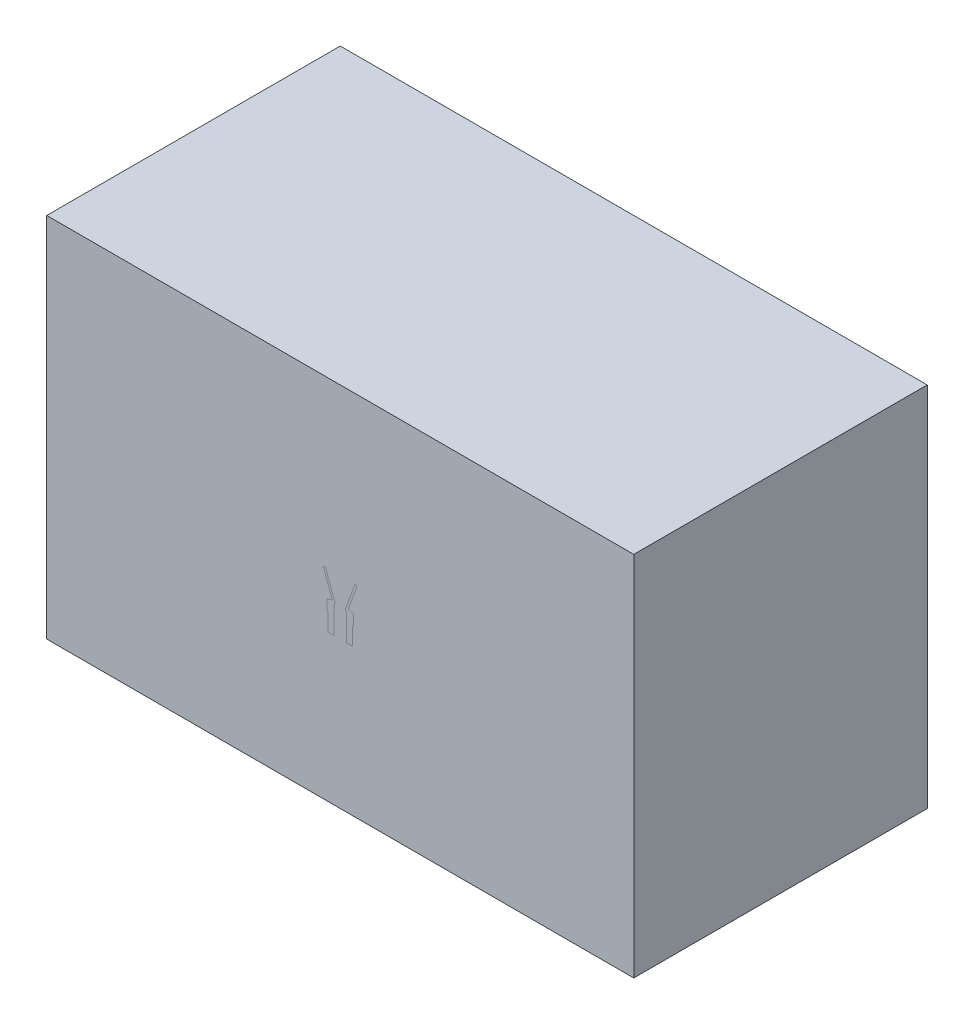
ISO-10303-21;
HEADER;
FILE_DESCRIPTION(('STEP AP214'),'2;1');
FILE_NAME('part.step','',(''),(''),'','','');
FILE_SCHEMA(('AUTOMOTIVE_DESIGN { 1 0 10303 214 1 1 1 1 }'));
ENDSEC;
DATA;
#1=APPLICATION_CONTEXT('core data for automotive mechanical design processes');
#2=APPLICATION_PROTOCOL_DEFINITION('international standard','automotive_design',2000,#1);
#3=PRODUCT_CONTEXT('',#1,'mechanical');
#4=PRODUCT('Part','Part','',(#3));
#5=PRODUCT_RELATED_PRODUCT_CATEGORY('part','',(#4));
#6=PRODUCT_DEFINITION_FORMATION('','',#4);
#7=PRODUCT_DEFINITION_CONTEXT('part definition',#1,'design');
#8=PRODUCT_DEFINITION('design','',#6,#7);
#9=PRODUCT_DEFINITION_SHAPE('','',#8);
#10=(LENGTH_UNIT() NAMED_UNIT(*) SI_UNIT(.MILLI.,.METRE.));
#11=(NAMED_UNIT(*) PLANE_ANGLE_UNIT() SI_UNIT($,.RADIAN.));
#12=(NAMED_UNIT(*) SI_UNIT($,.STERADIAN.) SOLID_ANGLE_UNIT());
#13=UNCERTAINTY_MEASURE_WITH_UNIT(LENGTH_MEASURE(1.E-05),#10,'distance_accuracy_value','');
#14=(GEOMETRIC_REPRESENTATION_CONTEXT(3) GLOBAL_UNCERTAINTY_ASSIGNED_CONTEXT((#13)) GLOBAL_UNIT_ASSIGNED_CONTEXT((#10,
#11,#12)) REPRESENTATION_CONTEXT('',''));
#15=CARTESIAN_POINT('',(0.,0.,0.));
#16=DIRECTION('',(0.,0.,1.));
#17=DIRECTION('',(1.,0.,0.));
#18=AXIS2_PLACEMENT_3D('',#15,#16,#17);
#19=CARTESIAN_POINT('',(0.,941.954291822987,0.));
#20=DIRECTION('',(0.,1.,0.));
#21=DIRECTION('',(0.,0.,1.));
#22=AXIS2_PLACEMENT_3D('',#19,#20,#21);
#23=TOROIDAL_SURFACE('',#22,265.023984913654,12.7);
#24=CARTESIAN_POINT('',(0.,946.297947643223,0.));
#25=DIRECTION('',(0.,-1.,0.));
#26=DIRECTION('',(0.,0.,-1.));
#27=AXIS2_PLACEMENT_3D('',#24,#25,#26);
#28=CIRCLE('',#27,253.089888629673);
#29=CARTESIAN_POINT('',(253.089888629673,946.297947643223,0.));
#30=VERTEX_POINT('',#29);
#31=CARTESIAN_POINT('',(-253.089888629673,946.297947643223,0.));
#32=VERTEX_POINT('',#31);
#33=EDGE_CURVE('E175',#30,#32,#28,.F.);
#34=ORIENTED_EDGE('',*,*,#33,.F.);
#35=CARTESIAN_POINT('',(265.023984913654,941.954291822987,0.));
#36=DIRECTION('',(0.,0.,1.));
#37=DIRECTION('',(1.,0.,0.));
#38=AXIS2_PLACEMENT_3D('',#35,#36,#37);
#39=CIRCLE('',#38,12.7);
#40=CARTESIAN_POINT('',(269.36764073389,953.888388106968,0.));
#41=VERTEX_POINT('',#40);
#42=EDGE_CURVE('E214',#30,#41,#39,.F.);
#43=ORIENTED_EDGE('',*,*,#42,.T.);
#44=CARTESIAN_POINT('',(0.,953.888388106968,0.));
#45=DIRECTION('',(0.,1.,0.));
#46=DIRECTION('',(0.,0.,1.));
#47=AXIS2_PLACEMENT_3D('',#44,#45,#46);
#48=CIRCLE('',#47,269.36764073389);
#49=CARTESIAN_POINT('',(-269.36764073389,953.888388106968,0.));
#50=VERTEX_POINT('',#49);
#51=EDGE_CURVE('E169',#50,#41,#48,.F.);
#52=ORIENTED_EDGE('',*,*,#51,.F.);
#53=CARTESIAN_POINT('',(-265.023984913654,941.954291822987,0.));
#54=DIRECTION('',(0.,0.,1.));
#55=DIRECTION('',(1.,0.,0.));
#56=AXIS2_PLACEMENT_3D('',#53,#54,#55);
#57=CIRCLE('',#56,12.7);
#58=EDGE_CURVE('E177',#50,#32,#57,.F.);
#59=ORIENTED_EDGE('',*,*,#58,.T.);
#60=EDGE_LOOP('',(#34,#43,#52,#59));
#61=FACE_BOUND('',#60,.T.);
#62=ADVANCED_FACE('F53',(#61),#23,.T.);
#63=CARTESIAN_POINT('',(0.,937.610636002752,0.));
#64=DIRECTION('',(0.,1.,0.));
#65=DIRECTION('',(0.,0.,1.));
#66=AXIS2_PLACEMENT_3D('',#63,#64,#65);
#67=TOROIDAL_SURFACE('',#66,276.958081197635,12.7);
#68=CARTESIAN_POINT('',(0.,949.544732286733,0.));
#69=DIRECTION('',(0.,1.,0.));
#70=DIRECTION('',(0.,0.,1.));
#71=AXIS2_PLACEMENT_3D('',#68,#69,#70);
#72=CIRCLE('',#71,281.301737017871);
#73=CARTESIAN_POINT('',(281.301737017871,949.544732286733,0.));
#74=VERTEX_POINT('',#73);
#75=CARTESIAN_POINT('',(-281.301737017871,949.544732286733,0.));
#76=VERTEX_POINT('',#75);
#77=EDGE_CURVE('E172',#74,#76,#72,.T.);
#78=ORIENTED_EDGE('',*,*,#77,.F.);
#79=CARTESIAN_POINT('',(276.958081197635,937.610636002752,0.));
#80=DIRECTION('',(0.,0.,1.));
#81=DIRECTION('',(1.,0.,0.));
#82=AXIS2_PLACEMENT_3D('',#79,#80,#81);
#83=CIRCLE('',#82,12.7);
#84=CARTESIAN_POINT('',(288.892177481616,933.266980182516,0.));
#85=VERTEX_POINT('',#84);
#86=EDGE_CURVE('E242',#74,#85,#83,.F.);
#87=ORIENTED_EDGE('',*,*,#86,.T.);
#88=CARTESIAN_POINT('',(0.,933.266980182516,0.));
#89=DIRECTION('',(0.,-1.,0.));
#90=DIRECTION('',(0.,0.,-1.));
#91=AXIS2_PLACEMENT_3D('',#88,#89,#90);
#92=CIRCLE('',#91,288.892177481616);
#93=CARTESIAN_POINT('',(-288.892177481616,933.266980182516,0.));
#94=VERTEX_POINT('',#93);
#95=EDGE_CURVE('E163',#94,#85,#92,.T.);
#96=ORIENTED_EDGE('',*,*,#95,.F.);
#97=CARTESIAN_POINT('',(-276.958081197635,937.610636002752,0.));
#98=DIRECTION('',(0.,0.,1.));
#99=DIRECTION('',(1.,0.,0.));
#100=AXIS2_PLACEMENT_3D('',#97,#98,#99);
#101=CIRCLE('',#100,12.7);
#102=EDGE_CURVE('E226',#94,#76,#101,.F.);
#103=ORIENTED_EDGE('',*,*,#102,.T.);
#104=EDGE_LOOP('',(#78,#87,#96,#103));
#105=FACE_BOUND('',#104,.T.);
#106=ADVANCED_FACE('F235',(#105),#67,.T.);
#107=CARTESIAN_POINT('',(0.,494.161666849678,0.));
#108=DIRECTION('',(0.,-1.,0.));
#109=DIRECTION('',(0.,0.,-1.));
#110=AXIS2_PLACEMENT_3D('',#107,#108,#109);
#111=TOROIDAL_SURFACE('',#110,142.585971430776,50.8);
#112=CARTESIAN_POINT('',(0.,511.536290130622,0.));
#113=DIRECTION('',(0.,-1.,0.));
#114=DIRECTION('',(0.,0.,-1.));
#115=AXIS2_PLACEMENT_3D('',#112,#113,#114);
#116=CIRCLE('',#115,94.8495862948517);
#117=CARTESIAN_POINT('',(-94.8495862948517,511.536290130622,0.));
#118=VERTEX_POINT('',#117);
#119=CARTESIAN_POINT('',(94.8495862948517,511.536290130622,0.));
#120=VERTEX_POINT('',#119);
#121=EDGE_CURVE('E158',#118,#120,#116,.T.);
#122=ORIENTED_EDGE('',*,*,#121,.F.);
#123=CARTESIAN_POINT('',(-142.585971430776,494.161666849678,0.));
#124=DIRECTION('',(0.,0.,1.));
#125=DIRECTION('',(1.,0.,0.));
#126=AXIS2_PLACEMENT_3D('',#123,#124,#125);
#127=CIRCLE('',#126,50.8);
#128=CARTESIAN_POINT('',(-107.95,457.,0.));
#129=VERTEX_POINT('',#128);
#130=EDGE_CURVE('E224',#118,#129,#127,.F.);
#131=ORIENTED_EDGE('',*,*,#130,.T.);
#132=CARTESIAN_POINT('',(0.,457.,0.));
#133=DIRECTION('',(0.,1.,0.));
#134=DIRECTION('',(0.,0.,1.));
#135=AXIS2_PLACEMENT_3D('',#132,#133,#134);
#136=CIRCLE('',#135,107.95);
#137=CARTESIAN_POINT('',(107.95,457.,0.));
#138=VERTEX_POINT('',#137);
#139=EDGE_CURVE('E197',#138,#129,#136,.T.);
#140=ORIENTED_EDGE('',*,*,#139,.F.);
#141=CARTESIAN_POINT('',(142.585971430776,494.161666849678,0.));
#142=DIRECTION('',(0.,0.,1.));
#143=DIRECTION('',(1.,0.,0.));
#144=AXIS2_PLACEMENT_3D('',#141,#142,#143);
#145=CIRCLE('',#144,50.8);
#146=EDGE_CURVE('E244',#138,#120,#145,.F.);
#147=ORIENTED_EDGE('',*,*,#146,.T.);
#148=EDGE_LOOP('',(#122,#131,#140,#147));
#149=FACE_BOUND('',#148,.T.);
#150=ADVANCED_FACE('F281',(#149),#111,.T.);
#151=CARTESIAN_POINT('',(0.,457.,0.));
#152=DIRECTION('',(0.,1.,0.));
#153=DIRECTION('',(0.,0.,1.));
#154=AXIS2_PLACEMENT_3D('',#151,#152,#153);
#155=CONICAL_SURFACE('',#154,75.,0.349065850398861);
#156=DIRECTION('',(0.342020143325664,0.93969262078591,0.));
#157=VECTOR('',#156,1.);
#158=CARTESIAN_POINT('',(0.,250.9391935409,0.));
#159=LINE('',#158,#157);
#160=EDGE_CURVE('E241',#30,#120,#159,.F.);
#161=ORIENTED_EDGE('',*,*,#160,.F.);
#162=ORIENTED_EDGE('',*,*,#33,.T.);
#163=DIRECTION('',(0.342020143325664,-0.93969262078591,0.));
#164=VECTOR('',#163,1.);
#165=CARTESIAN_POINT('',(0.,250.9391935409,0.));
#166=LINE('',#165,#164);
#167=EDGE_CURVE('E183',#118,#32,#166,.F.);
#168=ORIENTED_EDGE('',*,*,#167,.F.);
#169=ORIENTED_EDGE('',*,*,#121,.T.);
#170=EDGE_LOOP('',(#161,#162,#168,#169));
#171=FACE_BOUND('',#170,.T.);
#172=ADVANCED_FACE('F273',(#171),#155,.F.);
#173=CARTESIAN_POINT('',(0.,958.232043927204,0.));
#174=DIRECTION('',(0.,-1.,0.));
#175=DIRECTION('',(0.,0.,-1.));
#176=AXIS2_PLACEMENT_3D('',#173,#174,#175);
#177=CONICAL_SURFACE('',#176,257.433544449909,1.22173047639604);
#178=DIRECTION('',(-0.93969262078591,-0.342020143325664,0.));
#179=VECTOR('',#178,1.);
#180=CARTESIAN_POINT('',(0.,1051.93019140862,0.));
#181=LINE('',#180,#179);
#182=EDGE_CURVE('E187',#50,#76,#181,.T.);
#183=ORIENTED_EDGE('',*,*,#182,.F.);
#184=ORIENTED_EDGE('',*,*,#51,.T.);
#185=DIRECTION('',(-0.93969262078591,0.342020143325664,0.));
#186=VECTOR('',#185,1.);
#187=CARTESIAN_POINT('',(0.,1051.93019140862,0.));
#188=LINE('',#187,#186);
#189=EDGE_CURVE('E239',#74,#41,#188,.T.);
#190=ORIENTED_EDGE('',*,*,#189,.F.);
#191=ORIENTED_EDGE('',*,*,#77,.T.);
#192=EDGE_LOOP('',(#183,#184,#190,#191));
#193=FACE_BOUND('',#192,.T.);
#194=ADVANCED_FACE('F238',(#193),#177,.T.);
#195=CARTESIAN_POINT('',(0.,945.201076466497,0.));
#196=DIRECTION('',(0.,1.,0.));
#197=DIRECTION('',(0.,0.,1.));
#198=AXIS2_PLACEMENT_3D('',#195,#196,#197);
#199=CONICAL_SURFACE('',#198,293.235833301852,0.34906585039886);
#200=DIRECTION('',(0.342020143325663,0.93969262078591,0.));
#201=VECTOR('',#200,1.);
#202=CARTESIAN_POINT('',(0.,139.542245894684,0.));
#203=LINE('',#202,#201);
#204=CARTESIAN_POINT('',(137.489122711016,517.290505963834,0.));
#205=VERTEX_POINT('',#204);
#206=EDGE_CURVE('E249',#205,#85,#203,.T.);
#207=ORIENTED_EDGE('',*,*,#206,.F.);
#208=CARTESIAN_POINT('',(0.,517.290505963834,0.));
#209=DIRECTION('',(0.,-1.,0.));
#210=DIRECTION('',(0.,0.,-1.));
#211=AXIS2_PLACEMENT_3D('',#208,#209,#210);
#212=CIRCLE('',#211,137.489122711016);
#213=CARTESIAN_POINT('',(-137.489122711016,517.290505963834,0.));
#214=VERTEX_POINT('',#213);
#215=EDGE_CURVE('E146',#214,#205,#212,.T.);
#216=ORIENTED_EDGE('',*,*,#215,.F.);
#217=DIRECTION('',(0.342020143325663,-0.93969262078591,0.));
#218=VECTOR('',#217,1.);
#219=CARTESIAN_POINT('',(0.,139.542245894684,0.));
#220=LINE('',#219,#218);
#221=EDGE_CURVE('E222',#94,#214,#220,.T.);
#222=ORIENTED_EDGE('',*,*,#221,.F.);
#223=ORIENTED_EDGE('',*,*,#95,.T.);
#224=EDGE_LOOP('',(#207,#216,#222,#223));
#225=FACE_BOUND('',#224,.T.);
#226=ADVANCED_FACE('F265',(#225),#199,.T.);
#227=CARTESIAN_POINT('',(0.,517.290505963834,0.));
#228=DIRECTION('',(0.,-1.,0.));
#229=DIRECTION('',(0.,0.,-1.));
#230=AXIS2_PLACEMENT_3D('',#227,#228,#229);
#231=CONICAL_SURFACE('',#230,137.489122711016,1.22173047639604);
#232=DIRECTION('',(-0.93969262078591,-0.342020143325663,0.));
#233=VECTOR('',#232,1.);
#234=CARTESIAN_POINT('',(0.,567.332454166017,0.));
#235=LINE('',#234,#233);
#236=CARTESIAN_POINT('',(-233.35,482.4,0.));
#237=VERTEX_POINT('',#236);
#238=EDGE_CURVE('E220',#214,#237,#235,.T.);
#239=ORIENTED_EDGE('',*,*,#238,.F.);
#240=ORIENTED_EDGE('',*,*,#215,.T.);
#241=DIRECTION('',(-0.93969262078591,0.342020143325663,0.));
#242=VECTOR('',#241,1.);
#243=CARTESIAN_POINT('',(0.,567.332454166017,0.));
#244=LINE('',#243,#242);
#245=CARTESIAN_POINT('',(233.35,482.4,0.));
#246=VERTEX_POINT('',#245);
#247=EDGE_CURVE('E251',#246,#205,#244,.T.);
#248=ORIENTED_EDGE('',*,*,#247,.F.);
#249=CARTESIAN_POINT('',(0.,482.4,0.));
#250=DIRECTION('',(0.,-1.,0.));
#251=DIRECTION('',(0.,0.,-1.));
#252=AXIS2_PLACEMENT_3D('',#249,#250,#251);
#253=CIRCLE('',#252,233.35);
#254=EDGE_CURVE('E193',#237,#246,#253,.T.);
#255=ORIENTED_EDGE('',*,*,#254,.F.);
#256=EDGE_LOOP('',(#239,#240,#248,#255));
#257=FACE_BOUND('',#256,.T.);
#258=ADVANCED_FACE('F260',(#257),#231,.T.);
#259=CARTESIAN_POINT('',(0.,0.,0.));
#260=DIRECTION('',(0.,-1.,0.));
#261=DIRECTION('',(0.,0.,-1.));
#262=AXIS2_PLACEMENT_3D('',#259,#260,#261);
#263=CYLINDRICAL_SURFACE('',#262,233.35);
#264=DIRECTION('',(0.,-1.,0.));
#265=VECTOR('',#264,1.);
#266=CARTESIAN_POINT('',(-233.35,0.,0.));
#267=LINE('',#266,#265);
#268=CARTESIAN_POINT('',(-233.35,307.,0.));
#269=VERTEX_POINT('',#268);
#270=EDGE_CURVE('E213',#237,#269,#267,.T.);
#271=ORIENTED_EDGE('',*,*,#270,.F.);
#272=ORIENTED_EDGE('',*,*,#254,.T.);
#273=DIRECTION('',(0.,-1.,0.));
#274=VECTOR('',#273,1.);
#275=CARTESIAN_POINT('',(233.35,0.,0.));
#276=LINE('',#275,#274);
#277=CARTESIAN_POINT('',(233.35,307.,0.));
#278=VERTEX_POINT('',#277);
#279=EDGE_CURVE('E153',#278,#246,#276,.F.);
#280=ORIENTED_EDGE('',*,*,#279,.F.);
#281=CARTESIAN_POINT('',(0.,307.,0.));
#282=DIRECTION('',(0.,-1.,0.));
#283=DIRECTION('',(0.,0.,-1.));
#284=AXIS2_PLACEMENT_3D('',#281,#282,#283);
#285=CIRCLE('',#284,233.35);
#286=EDGE_CURVE('E152',#269,#278,#285,.T.);
#287=ORIENTED_EDGE('',*,*,#286,.F.);
#288=EDGE_LOOP('',(#271,#272,#280,#287));
#289=FACE_BOUND('',#288,.T.);
#290=ADVANCED_FACE('F263',(#289),#263,.T.);
#291=CARTESIAN_POINT('',(-207.95,307.,0.));
#292=DIRECTION('',(0.,1.,0.));
#293=DIRECTION('',(0.,0.,1.));
#294=AXIS2_PLACEMENT_3D('',#291,#292,#293);
#295=PLANE('',#294);
#296=DIRECTION('',(1.,0.,0.));
#297=VECTOR('',#296,1.);
#298=CARTESIAN_POINT('',(-207.95,307.,0.));
#299=LINE('',#298,#297);
#300=CARTESIAN_POINT('',(-207.95,307.,0.));
#301=VERTEX_POINT('',#300);
#302=EDGE_CURVE('E75',#269,#301,#299,.T.);
#303=ORIENTED_EDGE('',*,*,#302,.F.);
#304=ORIENTED_EDGE('',*,*,#286,.T.);
#305=CARTESIAN_POINT('',(207.95,307.,0.));
#306=VERTEX_POINT('',#305);
#307=EDGE_CURVE('E140',#306,#278,#299,.T.);
#308=ORIENTED_EDGE('',*,*,#307,.F.);
#309=CARTESIAN_POINT('',(0.,307.,0.));
#310=DIRECTION('',(0.,1.,0.));
#311=DIRECTION('',(0.,0.,1.));
#312=AXIS2_PLACEMENT_3D('',#309,#310,#311);
#313=CIRCLE('',#312,207.95);
#314=EDGE_CURVE('E150',#306,#301,#313,.T.);
#315=ORIENTED_EDGE('',*,*,#314,.T.);
#316=EDGE_LOOP('',(#303,#304,#308,#315));
#317=FACE_BOUND('',#316,.T.);
#318=ADVANCED_FACE('F55',(#317),#295,.F.);
#319=CARTESIAN_POINT('',(0.,457.,0.));
#320=DIRECTION('',(0.,-1.,0.));
#321=DIRECTION('',(0.,0.,-1.));
#322=AXIS2_PLACEMENT_3D('',#319,#320,#321);
#323=CYLINDRICAL_SURFACE('',#322,107.95);
#324=ORIENTED_EDGE('',*,*,#139,.T.);
#325=DIRECTION('',(0.,-1.,0.));
#326=VECTOR('',#325,1.);
#327=CARTESIAN_POINT('',(-107.95,457.,0.));
#328=LINE('',#327,#326);
#329=CARTESIAN_POINT('',(-107.95,0.,0.));
#330=VERTEX_POINT('',#329);
#331=EDGE_CURVE('E210',#129,#330,#328,.T.);
#332=ORIENTED_EDGE('',*,*,#331,.T.);
#333=CARTESIAN_POINT('',(0.,0.,0.));
#334=DIRECTION('',(0.,1.,0.));
#335=DIRECTION('',(0.,0.,1.));
#336=AXIS2_PLACEMENT_3D('',#333,#334,#335);
#337=CIRCLE('',#336,107.95);
#338=CARTESIAN_POINT('',(107.95,0.,0.));
#339=VERTEX_POINT('',#338);
#340=EDGE_CURVE('E160',#339,#330,#337,.T.);
#341=ORIENTED_EDGE('',*,*,#340,.F.);
#342=DIRECTION('',(0.,-1.,0.));
#343=VECTOR('',#342,1.);
#344=CARTESIAN_POINT('',(107.95,457.,0.));
#345=LINE('',#344,#343);
#346=EDGE_CURVE('E154',#339,#138,#345,.F.);
#347=ORIENTED_EDGE('',*,*,#346,.T.);
#348=EDGE_LOOP('',(#324,#332,#341,#347));
#349=FACE_BOUND('',#348,.T.);
#350=ADVANCED_FACE('F208',(#349),#323,.F.);
#351=CARTESIAN_POINT('',(0.,0.,0.));
#352=DIRECTION('',(0.,1.,0.));
#353=DIRECTION('',(0.,0.,1.));
#354=AXIS2_PLACEMENT_3D('',#351,#352,#353);
#355=PLANE('',#354);
#356=DIRECTION('',(1.,0.,0.));
#357=VECTOR('',#356,1.);
#358=CARTESIAN_POINT('',(0.,0.,0.));
#359=LINE('',#358,#357);
#360=CARTESIAN_POINT('',(-207.95,0.,0.));
#361=VERTEX_POINT('',#360);
#362=EDGE_CURVE('E204',#361,#330,#359,.T.);
#363=ORIENTED_EDGE('',*,*,#362,.F.);
#364=CARTESIAN_POINT('',(0.,0.,0.));
#365=DIRECTION('',(0.,1.,0.));
#366=DIRECTION('',(0.,0.,1.));
#367=AXIS2_PLACEMENT_3D('',#364,#365,#366);
#368=CIRCLE('',#367,207.95);
#369=CARTESIAN_POINT('',(207.95,0.,0.));
#370=VERTEX_POINT('',#369);
#371=EDGE_CURVE('E157',#370,#361,#368,.T.);
#372=ORIENTED_EDGE('',*,*,#371,.F.);
#373=EDGE_CURVE('E68',#339,#370,#359,.T.);
#374=ORIENTED_EDGE('',*,*,#373,.F.);
#375=ORIENTED_EDGE('',*,*,#340,.T.);
#376=EDGE_LOOP('',(#363,#372,#374,#375));
#377=FACE_BOUND('',#376,.T.);
#378=ADVANCED_FACE('F203',(#377),#355,.F.);
#379=CARTESIAN_POINT('',(0.,457.,0.));
#380=DIRECTION('',(0.,-1.,0.));
#381=DIRECTION('',(0.,0.,-1.));
#382=AXIS2_PLACEMENT_3D('',#379,#380,#381);
#383=CYLINDRICAL_SURFACE('',#382,207.95);
#384=DIRECTION('',(0.,-1.,0.));
#385=VECTOR('',#384,1.);
#386=CARTESIAN_POINT('',(-207.95,457.,0.));
#387=LINE('',#386,#385);
#388=EDGE_CURVE('E12',#301,#361,#387,.T.);
#389=ORIENTED_EDGE('',*,*,#388,.F.);
#390=ORIENTED_EDGE('',*,*,#314,.F.);
#391=DIRECTION('',(0.,-1.,0.));
#392=VECTOR('',#391,1.);
#393=CARTESIAN_POINT('',(207.95,457.,0.));
#394=LINE('',#393,#392);
#395=EDGE_CURVE('E61',#370,#306,#394,.F.);
#396=ORIENTED_EDGE('',*,*,#395,.F.);
#397=ORIENTED_EDGE('',*,*,#371,.T.);
#398=EDGE_LOOP('',(#389,#390,#396,#397));
#399=FACE_BOUND('',#398,.T.);
#400=ADVANCED_FACE('F156',(#399),#383,.T.);
#401=CARTESIAN_POINT('',(0.,0.,0.));
#402=DIRECTION('',(0.,0.,1.));
#403=DIRECTION('',(1.,0.,0.));
#404=AXIS2_PLACEMENT_3D('',#401,#402,#403);
#405=PLANE('',#404);
#406=ORIENTED_EDGE('',*,*,#160,.T.);
#407=ORIENTED_EDGE('',*,*,#146,.F.);
#408=ORIENTED_EDGE('',*,*,#346,.F.);
#409=ORIENTED_EDGE('',*,*,#373,.T.);
#410=ORIENTED_EDGE('',*,*,#395,.T.);
#411=ORIENTED_EDGE('',*,*,#307,.T.);
#412=ORIENTED_EDGE('',*,*,#279,.T.);
#413=ORIENTED_EDGE('',*,*,#247,.T.);
#414=ORIENTED_EDGE('',*,*,#206,.T.);
#415=ORIENTED_EDGE('',*,*,#86,.F.);
#416=ORIENTED_EDGE('',*,*,#189,.T.);
#417=ORIENTED_EDGE('',*,*,#42,.F.);
#418=EDGE_LOOP('',(#406,#407,#408,#409,#410,#411,#412,#413,#414,#415,#416,#417));
#419=FACE_BOUND('',#418,.T.);
#420=ADVANCED_FACE('F139',(#419),#405,.T.);
#421=ORIENTED_EDGE('',*,*,#182,.T.);
#422=ORIENTED_EDGE('',*,*,#102,.F.);
#423=ORIENTED_EDGE('',*,*,#221,.T.);
#424=ORIENTED_EDGE('',*,*,#238,.T.);
#425=ORIENTED_EDGE('',*,*,#270,.T.);
#426=ORIENTED_EDGE('',*,*,#302,.T.);
#427=ORIENTED_EDGE('',*,*,#388,.T.);
#428=ORIENTED_EDGE('',*,*,#362,.T.);
#429=ORIENTED_EDGE('',*,*,#331,.F.);
#430=ORIENTED_EDGE('',*,*,#130,.F.);
#431=ORIENTED_EDGE('',*,*,#167,.T.);
#432=ORIENTED_EDGE('',*,*,#58,.F.);
#433=EDGE_LOOP('',(#421,#422,#423,#424,#425,#426,#427,#428,#429,#430,#431,#432));
#434=FACE_BOUND('',#433,.T.);
#435=ADVANCED_FACE('F229',(#434),#405,.T.);
#436=CLOSED_SHELL('',(#62,#106,#150,#172,#194,#226,#258,#290,#318,#350,#378,#400,#420,#435));
#437=MANIFOLD_SOLID_BREP('B2',#436);
#438=CARTESIAN_POINT('',(0.,941.954291822987,0.));
#439=DIRECTION('',(0.,1.,0.));
#440=DIRECTION('',(0.,0.,1.));
#441=AXIS2_PLACEMENT_3D('',#438,#439,#440);
#442=TOROIDAL_SURFACE('',#441,265.023984913654,12.7);
#443=CARTESIAN_POINT('',(265.023984913654,941.954291822987,0.));
#444=DIRECTION('',(0.,0.,1.));
#445=DIRECTION('',(1.,0.,0.));
#446=AXIS2_PLACEMENT_3D('',#443,#444,#445);
#447=CIRCLE('',#446,12.7);
#448=CARTESIAN_POINT('',(253.089888629673,946.297947643223,0.));
#449=VERTEX_POINT('',#448);
#450=CARTESIAN_POINT('',(269.36764073389,953.888388106968,0.));
#451=VERTEX_POINT('',#450);
#452=EDGE_CURVE('E627',#449,#451,#447,.F.);
#453=ORIENTED_EDGE('',*,*,#452,.F.);
#454=CARTESIAN_POINT('',(0.,946.297947643223,0.));
#455=DIRECTION('',(0.,-1.,0.));
#456=DIRECTION('',(0.,0.,-1.));
#457=AXIS2_PLACEMENT_3D('',#454,#455,#456);
#458=CIRCLE('',#457,253.089888629673);
#459=CARTESIAN_POINT('',(-253.089888629673,946.297947643223,0.));
#460=VERTEX_POINT('',#459);
#461=EDGE_CURVE('E573',#449,#460,#458,.F.);
#462=ORIENTED_EDGE('',*,*,#461,.T.);
#463=CARTESIAN_POINT('',(-265.023984913654,941.954291822987,0.));
#464=DIRECTION('',(0.,0.,1.));
#465=DIRECTION('',(1.,0.,0.));
#466=AXIS2_PLACEMENT_3D('',#463,#464,#465);
#467=CIRCLE('',#466,12.7);
#468=CARTESIAN_POINT('',(-269.36764073389,953.888388106968,0.));
#469=VERTEX_POINT('',#468);
#470=EDGE_CURVE('E655',#469,#460,#467,.F.);
#471=ORIENTED_EDGE('',*,*,#470,.F.);
#472=CARTESIAN_POINT('',(0.,953.888388106968,0.));
#473=DIRECTION('',(0.,1.,0.));
#474=DIRECTION('',(0.,0.,1.));
#475=AXIS2_PLACEMENT_3D('',#472,#473,#474);
#476=CIRCLE('',#475,269.36764073389);
#477=EDGE_CURVE('E565',#469,#451,#476,.F.);
#478=ORIENTED_EDGE('',*,*,#477,.T.);
#479=EDGE_LOOP('',(#453,#462,#471,#478));
#480=FACE_BOUND('',#479,.T.);
#481=ADVANCED_FACE('F413',(#480),#442,.F.);
#482=CARTESIAN_POINT('',(0.,937.610636002752,0.));
#483=DIRECTION('',(0.,1.,0.));
#484=DIRECTION('',(0.,0.,1.));
#485=AXIS2_PLACEMENT_3D('',#482,#483,#484);
#486=TOROIDAL_SURFACE('',#485,276.958081197635,12.7);
#487=CARTESIAN_POINT('',(276.958081197635,937.610636002752,0.));
#488=DIRECTION('',(0.,0.,1.));
#489=DIRECTION('',(1.,0.,0.));
#490=AXIS2_PLACEMENT_3D('',#487,#488,#489);
#491=CIRCLE('',#490,12.7);
#492=CARTESIAN_POINT('',(281.301737017871,949.544732286733,0.));
#493=VERTEX_POINT('',#492);
#494=CARTESIAN_POINT('',(288.892177481616,933.266980182516,0.));
#495=VERTEX_POINT('',#494);
#496=EDGE_CURVE('E729',#493,#495,#491,.F.);
#497=ORIENTED_EDGE('',*,*,#496,.F.);
#498=CARTESIAN_POINT('',(0.,949.544732286733,0.));
#499=DIRECTION('',(0.,1.,0.));
#500=DIRECTION('',(0.,0.,1.));
#501=AXIS2_PLACEMENT_3D('',#498,#499,#500);
#502=CIRCLE('',#501,281.301737017871);
#503=CARTESIAN_POINT('',(-281.301737017871,949.544732286733,0.));
#504=VERTEX_POINT('',#503);
#505=EDGE_CURVE('E569',#493,#504,#502,.T.);
#506=ORIENTED_EDGE('',*,*,#505,.T.);
#507=CARTESIAN_POINT('',(-276.958081197635,937.610636002752,0.));
#508=DIRECTION('',(0.,0.,1.));
#509=DIRECTION('',(1.,0.,0.));
#510=AXIS2_PLACEMENT_3D('',#507,#508,#509);
#511=CIRCLE('',#510,12.7);
#512=CARTESIAN_POINT('',(-288.892177481616,933.266980182516,0.));
#513=VERTEX_POINT('',#512);
#514=EDGE_CURVE('E644',#513,#504,#511,.F.);
#515=ORIENTED_EDGE('',*,*,#514,.F.);
#516=CARTESIAN_POINT('',(0.,933.266980182516,0.));
#517=DIRECTION('',(0.,-1.,0.));
#518=DIRECTION('',(0.,0.,-1.));
#519=AXIS2_PLACEMENT_3D('',#516,#517,#518);
#520=CIRCLE('',#519,288.892177481616);
#521=EDGE_CURVE('E561',#513,#495,#520,.T.);
#522=ORIENTED_EDGE('',*,*,#521,.T.);
#523=EDGE_LOOP('',(#497,#506,#515,#522));
#524=FACE_BOUND('',#523,.T.);
#525=ADVANCED_FACE('F711',(#524),#486,.F.);
#526=CARTESIAN_POINT('',(0.,494.161666849678,0.));
#527=DIRECTION('',(0.,-1.,0.));
#528=DIRECTION('',(0.,0.,-1.));
#529=AXIS2_PLACEMENT_3D('',#526,#527,#528);
#530=TOROIDAL_SURFACE('',#529,142.585971430776,50.8);
#531=CARTESIAN_POINT('',(-142.585971430776,494.161666849678,0.));
#532=DIRECTION('',(0.,0.,1.));
#533=DIRECTION('',(1.,0.,0.));
#534=AXIS2_PLACEMENT_3D('',#531,#532,#533);
#535=CIRCLE('',#534,50.8);
#536=CARTESIAN_POINT('',(-94.8495862948517,511.536290130622,0.));
#537=VERTEX_POINT('',#536);
#538=CARTESIAN_POINT('',(-107.95,457.,0.));
#539=VERTEX_POINT('',#538);
#540=EDGE_CURVE('E612',#537,#539,#535,.F.);
#541=ORIENTED_EDGE('',*,*,#540,.F.);
#542=CARTESIAN_POINT('',(0.,511.536290130622,0.));
#543=DIRECTION('',(0.,-1.,0.));
#544=DIRECTION('',(0.,0.,-1.));
#545=AXIS2_PLACEMENT_3D('',#542,#543,#544);
#546=CIRCLE('',#545,94.8495862948517);
#547=CARTESIAN_POINT('',(94.8495862948517,511.536290130622,0.));
#548=VERTEX_POINT('',#547);
#549=EDGE_CURVE('E554',#537,#548,#546,.T.);
#550=ORIENTED_EDGE('',*,*,#549,.T.);
#551=CARTESIAN_POINT('',(142.585971430776,494.161666849678,0.));
#552=DIRECTION('',(0.,0.,1.));
#553=DIRECTION('',(1.,0.,0.));
#554=AXIS2_PLACEMENT_3D('',#551,#552,#553);
#555=CIRCLE('',#554,50.8);
#556=CARTESIAN_POINT('',(107.95,457.,0.));
#557=VERTEX_POINT('',#556);
#558=EDGE_CURVE('E614',#557,#548,#555,.F.);
#559=ORIENTED_EDGE('',*,*,#558,.F.);
#560=CARTESIAN_POINT('',(0.,457.,0.));
#561=DIRECTION('',(0.,1.,0.));
#562=DIRECTION('',(0.,0.,1.));
#563=AXIS2_PLACEMENT_3D('',#560,#561,#562);
#564=CIRCLE('',#563,107.95);
#565=EDGE_CURVE('E552',#557,#539,#564,.T.);
#566=ORIENTED_EDGE('',*,*,#565,.T.);
#567=EDGE_LOOP('',(#541,#550,#559,#566));
#568=FACE_BOUND('',#567,.T.);
#569=ADVANCED_FACE('F611',(#568),#530,.F.);
#570=CARTESIAN_POINT('',(0.,457.,0.));
#571=DIRECTION('',(0.,1.,0.));
#572=DIRECTION('',(0.,0.,1.));
#573=AXIS2_PLACEMENT_3D('',#570,#571,#572);
#574=CONICAL_SURFACE('',#573,75.,0.349065850398861);
#575=ORIENTED_EDGE('',*,*,#461,.F.);
#576=DIRECTION('',(0.342020143325664,0.93969262078591,0.));
#577=VECTOR('',#576,1.);
#578=CARTESIAN_POINT('',(0.,250.9391935409,0.));
#579=LINE('',#578,#577);
#580=EDGE_CURVE('E719',#449,#548,#579,.F.);
#581=ORIENTED_EDGE('',*,*,#580,.T.);
#582=ORIENTED_EDGE('',*,*,#549,.F.);
#583=DIRECTION('',(0.342020143325664,-0.93969262078591,0.));
#584=VECTOR('',#583,1.);
#585=CARTESIAN_POINT('',(0.,250.9391935409,0.));
#586=LINE('',#585,#584);
#587=EDGE_CURVE('E651',#537,#460,#586,.F.);
#588=ORIENTED_EDGE('',*,*,#587,.T.);
#589=EDGE_LOOP('',(#575,#581,#582,#588));
#590=FACE_BOUND('',#589,.T.);
#591=ADVANCED_FACE('F722',(#590),#574,.T.);
#592=CARTESIAN_POINT('',(0.,958.232043927204,0.));
#593=DIRECTION('',(0.,-1.,0.));
#594=DIRECTION('',(0.,0.,-1.));
#595=AXIS2_PLACEMENT_3D('',#592,#593,#594);
#596=CONICAL_SURFACE('',#595,257.433544449909,1.22173047639604);
#597=ORIENTED_EDGE('',*,*,#477,.F.);
#598=DIRECTION('',(-0.93969262078591,-0.342020143325664,0.));
#599=VECTOR('',#598,1.);
#600=CARTESIAN_POINT('',(0.,1051.93019140862,0.));
#601=LINE('',#600,#599);
#602=EDGE_CURVE('E647',#469,#504,#601,.T.);
#603=ORIENTED_EDGE('',*,*,#602,.T.);
#604=ORIENTED_EDGE('',*,*,#505,.F.);
#605=DIRECTION('',(-0.93969262078591,0.342020143325664,0.));
#606=VECTOR('',#605,1.);
#607=CARTESIAN_POINT('',(0.,1051.93019140862,0.));
#608=LINE('',#607,#606);
#609=EDGE_CURVE('E726',#493,#451,#608,.T.);
#610=ORIENTED_EDGE('',*,*,#609,.T.);
#611=EDGE_LOOP('',(#597,#603,#604,#610));
#612=FACE_BOUND('',#611,.T.);
#613=ADVANCED_FACE('F724',(#612),#596,.F.);
#614=CARTESIAN_POINT('',(0.,945.201076466497,0.));
#615=DIRECTION('',(0.,1.,0.));
#616=DIRECTION('',(0.,0.,1.));
#617=AXIS2_PLACEMENT_3D('',#614,#615,#616);
#618=CONICAL_SURFACE('',#617,293.235833301852,0.34906585039886);
#619=CARTESIAN_POINT('',(0.,517.290505963834,0.));
#620=DIRECTION('',(0.,-1.,0.));
#621=DIRECTION('',(0.,0.,-1.));
#622=AXIS2_PLACEMENT_3D('',#619,#620,#621);
#623=CIRCLE('',#622,137.489122711016);
#624=CARTESIAN_POINT('',(-137.489122711016,517.290505963834,0.));
#625=VERTEX_POINT('',#624);
#626=CARTESIAN_POINT('',(137.489122711016,517.290505963834,0.));
#627=VERTEX_POINT('',#626);
#628=EDGE_CURVE('E533',#625,#627,#623,.T.);
#629=ORIENTED_EDGE('',*,*,#628,.T.);
#630=DIRECTION('',(0.342020143325663,0.93969262078591,0.));
#631=VECTOR('',#630,1.);
#632=CARTESIAN_POINT('',(0.,139.542245894684,0.));
#633=LINE('',#632,#631);
#634=EDGE_CURVE('E737',#627,#495,#633,.T.);
#635=ORIENTED_EDGE('',*,*,#634,.T.);
#636=ORIENTED_EDGE('',*,*,#521,.F.);
#637=DIRECTION('',(0.342020143325663,-0.93969262078591,0.));
#638=VECTOR('',#637,1.);
#639=CARTESIAN_POINT('',(0.,139.542245894684,0.));
#640=LINE('',#639,#638);
#641=EDGE_CURVE('E638',#513,#625,#640,.T.);
#642=ORIENTED_EDGE('',*,*,#641,.T.);
#643=EDGE_LOOP('',(#629,#635,#636,#642));
#644=FACE_BOUND('',#643,.T.);
#645=ADVANCED_FACE('F761',(#644),#618,.F.);
#646=CARTESIAN_POINT('',(0.,517.290505963834,0.));
#647=DIRECTION('',(0.,-1.,0.));
#648=DIRECTION('',(0.,0.,-1.));
#649=AXIS2_PLACEMENT_3D('',#646,#647,#648);
#650=CONICAL_SURFACE('',#649,137.489122711016,1.22173047639604);
#651=ORIENTED_EDGE('',*,*,#628,.F.);
#652=DIRECTION('',(-0.93969262078591,-0.342020143325663,0.));
#653=VECTOR('',#652,1.);
#654=CARTESIAN_POINT('',(0.,567.332454166017,0.));
#655=LINE('',#654,#653);
#656=CARTESIAN_POINT('',(-233.35,482.4,0.));
#657=VERTEX_POINT('',#656);
#658=EDGE_CURVE('E634',#625,#657,#655,.T.);
#659=ORIENTED_EDGE('',*,*,#658,.T.);
#660=CARTESIAN_POINT('',(0.,482.4,0.));
#661=DIRECTION('',(0.,-1.,0.));
#662=DIRECTION('',(0.,0.,-1.));
#663=AXIS2_PLACEMENT_3D('',#660,#661,#662);
#664=CIRCLE('',#663,233.35);
#665=CARTESIAN_POINT('',(233.35,482.4,0.));
#666=VERTEX_POINT('',#665);
#667=EDGE_CURVE('E598',#657,#666,#664,.T.);
#668=ORIENTED_EDGE('',*,*,#667,.T.);
#669=DIRECTION('',(-0.93969262078591,0.342020143325663,0.));
#670=VECTOR('',#669,1.);
#671=CARTESIAN_POINT('',(0.,567.332454166017,0.));
#672=LINE('',#671,#670);
#673=EDGE_CURVE('E741',#666,#627,#672,.T.);
#674=ORIENTED_EDGE('',*,*,#673,.T.);
#675=EDGE_LOOP('',(#651,#659,#668,#674));
#676=FACE_BOUND('',#675,.T.);
#677=ADVANCED_FACE('F759',(#676),#650,.F.);
#678=CARTESIAN_POINT('',(0.,0.,0.));
#679=DIRECTION('',(0.,-1.,0.));
#680=DIRECTION('',(0.,0.,-1.));
#681=AXIS2_PLACEMENT_3D('',#678,#679,#680);
#682=CYLINDRICAL_SURFACE('',#681,233.35);
#683=ORIENTED_EDGE('',*,*,#667,.F.);
#684=DIRECTION('',(0.,-1.,0.));
#685=VECTOR('',#684,1.);
#686=CARTESIAN_POINT('',(-233.35,0.,0.));
#687=LINE('',#686,#685);
#688=CARTESIAN_POINT('',(-233.35,307.,0.));
#689=VERTEX_POINT('',#688);
#690=EDGE_CURVE('E625',#657,#689,#687,.T.);
#691=ORIENTED_EDGE('',*,*,#690,.T.);
#692=CARTESIAN_POINT('',(0.,307.,0.));
#693=DIRECTION('',(0.,-1.,0.));
#694=DIRECTION('',(0.,0.,-1.));
#695=AXIS2_PLACEMENT_3D('',#692,#693,#694);
#696=CIRCLE('',#695,233.35);
#697=CARTESIAN_POINT('',(233.35,307.,0.));
#698=VERTEX_POINT('',#697);
#699=EDGE_CURVE('E602',#689,#698,#696,.T.);
#700=ORIENTED_EDGE('',*,*,#699,.T.);
#701=DIRECTION('',(0.,-1.,0.));
#702=VECTOR('',#701,1.);
#703=CARTESIAN_POINT('',(233.35,0.,0.));
#704=LINE('',#703,#702);
#705=EDGE_CURVE('E745',#698,#666,#704,.F.);
#706=ORIENTED_EDGE('',*,*,#705,.T.);
#707=EDGE_LOOP('',(#683,#691,#700,#706));
#708=FACE_BOUND('',#707,.T.);
#709=ADVANCED_FACE('F756',(#708),#682,.F.);
#710=CARTESIAN_POINT('',(-207.95,307.,0.));
#711=DIRECTION('',(0.,1.,0.));
#712=DIRECTION('',(0.,0.,1.));
#713=AXIS2_PLACEMENT_3D('',#710,#711,#712);
#714=PLANE('',#713);
#715=ORIENTED_EDGE('',*,*,#699,.F.);
#716=DIRECTION('',(1.,0.,0.));
#717=VECTOR('',#716,1.);
#718=CARTESIAN_POINT('',(-207.95,307.,0.));
#719=LINE('',#718,#717);
#720=CARTESIAN_POINT('',(-207.95,307.,0.));
#721=VERTEX_POINT('',#720);
#722=EDGE_CURVE('E620',#689,#721,#719,.T.);
#723=ORIENTED_EDGE('',*,*,#722,.T.);
#724=CARTESIAN_POINT('',(0.,307.,0.));
#725=DIRECTION('',(0.,1.,0.));
#726=DIRECTION('',(0.,0.,1.));
#727=AXIS2_PLACEMENT_3D('',#724,#725,#726);
#728=CIRCLE('',#727,207.95);
#729=CARTESIAN_POINT('',(207.95,307.,0.));
#730=VERTEX_POINT('',#729);
#731=EDGE_CURVE('E548',#730,#721,#728,.T.);
#732=ORIENTED_EDGE('',*,*,#731,.F.);
#733=EDGE_CURVE('E436',#730,#698,#719,.T.);
#734=ORIENTED_EDGE('',*,*,#733,.T.);
#735=EDGE_LOOP('',(#715,#723,#732,#734));
#736=FACE_BOUND('',#735,.T.);
#737=ADVANCED_FACE('F753',(#736),#714,.T.);
#738=CARTESIAN_POINT('',(0.,457.,0.));
#739=DIRECTION('',(0.,-1.,0.));
#740=DIRECTION('',(0.,0.,-1.));
#741=AXIS2_PLACEMENT_3D('',#738,#739,#740);
#742=CYLINDRICAL_SURFACE('',#741,107.95);
#743=DIRECTION('',(0.,-1.,0.));
#744=VECTOR('',#743,1.);
#745=CARTESIAN_POINT('',(-107.95,457.,0.));
#746=LINE('',#745,#744);
#747=CARTESIAN_POINT('',(-107.95,0.,0.));
#748=VERTEX_POINT('',#747);
#749=EDGE_CURVE('E618',#539,#748,#746,.T.);
#750=ORIENTED_EDGE('',*,*,#749,.F.);
#751=ORIENTED_EDGE('',*,*,#565,.F.);
#752=DIRECTION('',(0.,-1.,0.));
#753=VECTOR('',#752,1.);
#754=CARTESIAN_POINT('',(107.95,457.,0.));
#755=LINE('',#754,#753);
#756=CARTESIAN_POINT('',(107.95,0.,0.));
#757=VERTEX_POINT('',#756);
#758=EDGE_CURVE('E543',#757,#557,#755,.F.);
#759=ORIENTED_EDGE('',*,*,#758,.F.);
#760=CARTESIAN_POINT('',(0.,0.,0.));
#761=DIRECTION('',(0.,1.,0.));
#762=DIRECTION('',(0.,0.,1.));
#763=AXIS2_PLACEMENT_3D('',#760,#761,#762);
#764=CIRCLE('',#763,107.95);
#765=EDGE_CURVE('E541',#757,#748,#764,.T.);
#766=ORIENTED_EDGE('',*,*,#765,.T.);
#767=EDGE_LOOP('',(#750,#751,#759,#766));
#768=FACE_BOUND('',#767,.T.);
#769=ADVANCED_FACE('F617',(#768),#742,.T.);
#770=CARTESIAN_POINT('',(0.,0.,0.));
#771=DIRECTION('',(0.,1.,0.));
#772=DIRECTION('',(0.,0.,1.));
#773=AXIS2_PLACEMENT_3D('',#770,#771,#772);
#774=PLANE('',#773);
#775=CARTESIAN_POINT('',(0.,0.,0.));
#776=DIRECTION('',(0.,1.,0.));
#777=DIRECTION('',(0.,0.,1.));
#778=AXIS2_PLACEMENT_3D('',#775,#776,#777);
#779=CIRCLE('',#778,207.95);
#780=CARTESIAN_POINT('',(207.95,0.,0.));
#781=VERTEX_POINT('',#780);
#782=CARTESIAN_POINT('',(-207.95,0.,0.));
#783=VERTEX_POINT('',#782);
#784=EDGE_CURVE('E539',#781,#783,#779,.T.);
#785=ORIENTED_EDGE('',*,*,#784,.T.);
#786=DIRECTION('',(1.,0.,0.));
#787=VECTOR('',#786,1.);
#788=CARTESIAN_POINT('',(0.,0.,0.));
#789=LINE('',#788,#787);
#790=EDGE_CURVE('E545',#783,#748,#789,.T.);
#791=ORIENTED_EDGE('',*,*,#790,.T.);
#792=ORIENTED_EDGE('',*,*,#765,.F.);
#793=EDGE_CURVE('E526',#757,#781,#789,.T.);
#794=ORIENTED_EDGE('',*,*,#793,.T.);
#795=EDGE_LOOP('',(#785,#791,#792,#794));
#796=FACE_BOUND('',#795,.T.);
#797=ADVANCED_FACE('F537',(#796),#774,.T.);
#798=CARTESIAN_POINT('',(0.,457.,0.));
#799=DIRECTION('',(0.,-1.,0.));
#800=DIRECTION('',(0.,0.,-1.));
#801=AXIS2_PLACEMENT_3D('',#798,#799,#800);
#802=CYLINDRICAL_SURFACE('',#801,207.95);
#803=ORIENTED_EDGE('',*,*,#731,.T.);
#804=DIRECTION('',(0.,-1.,0.));
#805=VECTOR('',#804,1.);
#806=CARTESIAN_POINT('',(-207.95,457.,0.));
#807=LINE('',#806,#805);
#808=EDGE_CURVE('E51',#721,#783,#807,.T.);
#809=ORIENTED_EDGE('',*,*,#808,.T.);
#810=ORIENTED_EDGE('',*,*,#784,.F.);
#811=DIRECTION('',(0.,-1.,0.));
#812=VECTOR('',#811,1.);
#813=CARTESIAN_POINT('',(207.95,457.,0.));
#814=LINE('',#813,#812);
#815=EDGE_CURVE('E421',#781,#730,#814,.F.);
#816=ORIENTED_EDGE('',*,*,#815,.T.);
#817=EDGE_LOOP('',(#803,#809,#810,#816));
#818=FACE_BOUND('',#817,.T.);
#819=ADVANCED_FACE('F546',(#818),#802,.F.);
#820=CARTESIAN_POINT('',(0.,0.,0.));
#821=DIRECTION('',(0.,0.,1.));
#822=DIRECTION('',(1.,0.,0.));
#823=AXIS2_PLACEMENT_3D('',#820,#821,#822);
#824=PLANE('',#823);
#825=DIRECTION('',(-1.,0.,0.));
#826=VECTOR('',#825,1.);
#827=CARTESIAN_POINT('',(5080.,3810.,0.));
#828=LINE('',#827,#826);
#829=CARTESIAN_POINT('',(5080.,3810.,0.));
#830=VERTEX_POINT('',#829);
#831=CARTESIAN_POINT('',(-5080.,3810.,1.77635683940025E-12));
#832=VERTEX_POINT('',#831);
#833=EDGE_CURVE('E428',#830,#832,#828,.T.);
#834=ORIENTED_EDGE('',*,*,#833,.T.);
#835=DIRECTION('',(0.,-1.,0.));
#836=VECTOR('',#835,1.);
#837=CARTESIAN_POINT('',(-5080.,0.,0.));
#838=LINE('',#837,#836);
#839=CARTESIAN_POINT('',(-5080.,-2540.,0.));
#840=VERTEX_POINT('',#839);
#841=EDGE_CURVE('E658',#832,#840,#838,.T.);
#842=ORIENTED_EDGE('',*,*,#841,.T.);
#843=DIRECTION('',(1.,0.,0.));
#844=VECTOR('',#843,1.);
#845=CARTESIAN_POINT('',(5080.,-2540.,0.));
#846=LINE('',#845,#844);
#847=CARTESIAN_POINT('',(5080.,-2540.,0.));
#848=VERTEX_POINT('',#847);
#849=EDGE_CURVE('E663',#840,#848,#846,.T.);
#850=ORIENTED_EDGE('',*,*,#849,.T.);
#851=DIRECTION('',(0.,-1.,0.));
#852=VECTOR('',#851,1.);
#853=CARTESIAN_POINT('',(5080.,0.,0.));
#854=LINE('',#853,#852);
#855=EDGE_CURVE('E666',#830,#848,#854,.T.);
#856=ORIENTED_EDGE('',*,*,#855,.F.);
#857=EDGE_LOOP('',(#834,#842,#850,#856));
#858=FACE_BOUND('',#857,.T.);
#859=ORIENTED_EDGE('',*,*,#452,.T.);
#860=ORIENTED_EDGE('',*,*,#609,.F.);
#861=ORIENTED_EDGE('',*,*,#496,.T.);
#862=ORIENTED_EDGE('',*,*,#634,.F.);
#863=ORIENTED_EDGE('',*,*,#673,.F.);
#864=ORIENTED_EDGE('',*,*,#705,.F.);
#865=ORIENTED_EDGE('',*,*,#733,.F.);
#866=ORIENTED_EDGE('',*,*,#815,.F.);
#867=ORIENTED_EDGE('',*,*,#793,.F.);
#868=ORIENTED_EDGE('',*,*,#758,.T.);
#869=ORIENTED_EDGE('',*,*,#558,.T.);
#870=ORIENTED_EDGE('',*,*,#580,.F.);
#871=EDGE_LOOP('',(#859,#860,#861,#862,#863,#864,#865,#866,#867,#868,#869,#870));
#872=FACE_BOUND('',#871,.T.);
#873=ORIENTED_EDGE('',*,*,#470,.T.);
#874=ORIENTED_EDGE('',*,*,#587,.F.);
#875=ORIENTED_EDGE('',*,*,#540,.T.);
#876=ORIENTED_EDGE('',*,*,#749,.T.);
#877=ORIENTED_EDGE('',*,*,#790,.F.);
#878=ORIENTED_EDGE('',*,*,#808,.F.);
#879=ORIENTED_EDGE('',*,*,#722,.F.);
#880=ORIENTED_EDGE('',*,*,#690,.F.);
#881=ORIENTED_EDGE('',*,*,#658,.F.);
#882=ORIENTED_EDGE('',*,*,#641,.F.);
#883=ORIENTED_EDGE('',*,*,#514,.T.);
#884=ORIENTED_EDGE('',*,*,#602,.F.);
#885=EDGE_LOOP('',(#873,#874,#875,#876,#877,#878,#879,#880,#881,#882,#883,#884));
#886=FACE_BOUND('',#885,.T.);
#887=ADVANCED_FACE('F524',(#858,#872,#886),#824,.T.);
#888=CARTESIAN_POINT('',(5080.,-2540.,5080.));
#889=DIRECTION('',(0.,1.,0.));
#890=DIRECTION('',(0.,0.,1.));
#891=AXIS2_PLACEMENT_3D('',#888,#889,#890);
#892=PLANE('',#891);
#893=ORIENTED_EDGE('',*,*,#849,.F.);
#894=DIRECTION('',(0.,0.,-1.));
#895=VECTOR('',#894,1.);
#896=CARTESIAN_POINT('',(-5080.,-2540.,5080.));
#897=LINE('',#896,#895);
#898=CARTESIAN_POINT('',(-5080.,-2540.,-5080.));
#899=VERTEX_POINT('',#898);
#900=EDGE_CURVE('E670',#840,#899,#897,.T.);
#901=ORIENTED_EDGE('',*,*,#900,.T.);
#902=DIRECTION('',(-1.,0.,0.));
#903=VECTOR('',#902,1.);
#904=CARTESIAN_POINT('',(5080.,-2540.,-5080.));
#905=LINE('',#904,#903);
#906=CARTESIAN_POINT('',(5080.,-2540.,-5080.));
#907=VERTEX_POINT('',#906);
#908=EDGE_CURVE('E576',#907,#899,#905,.T.);
#909=ORIENTED_EDGE('',*,*,#908,.F.);
#910=DIRECTION('',(0.,0.,-1.));
#911=VECTOR('',#910,1.);
#912=CARTESIAN_POINT('',(5080.,-2540.,5080.));
#913=LINE('',#912,#911);
#914=EDGE_CURVE('E671',#848,#907,#913,.T.);
#915=ORIENTED_EDGE('',*,*,#914,.F.);
#916=EDGE_LOOP('',(#893,#901,#909,#915));
#917=FACE_BOUND('',#916,.T.);
#918=ADVANCED_FACE('F698',(#917),#892,.F.);
#919=CARTESIAN_POINT('',(5080.,3810.00000000001,5080.));
#920=DIRECTION('',(0.,-1.,0.));
#921=DIRECTION('',(0.,0.,-1.));
#922=AXIS2_PLACEMENT_3D('',#919,#920,#921);
#923=PLANE('',#922);
#924=ORIENTED_EDGE('',*,*,#833,.F.);
#925=DIRECTION('',(0.,0.,1.));
#926=VECTOR('',#925,1.);
#927=CARTESIAN_POINT('',(5080.,3810.00000000001,5080.));
#928=LINE('',#927,#926);
#929=CARTESIAN_POINT('',(5080.,3810.,-5080.));
#930=VERTEX_POINT('',#929);
#931=EDGE_CURVE('E591',#930,#830,#928,.T.);
#932=ORIENTED_EDGE('',*,*,#931,.F.);
#933=DIRECTION('',(-1.,0.,0.));
#934=VECTOR('',#933,1.);
#935=CARTESIAN_POINT('',(5080.,3810.,-5080.));
#936=LINE('',#935,#934);
#937=CARTESIAN_POINT('',(-5080.,3810.,-5080.));
#938=VERTEX_POINT('',#937);
#939=EDGE_CURVE('E583',#930,#938,#936,.T.);
#940=ORIENTED_EDGE('',*,*,#939,.T.);
#941=DIRECTION('',(0.,0.,1.));
#942=VECTOR('',#941,1.);
#943=CARTESIAN_POINT('',(-5080.,3810.00000000001,5080.));
#944=LINE('',#943,#942);
#945=EDGE_CURVE('E675',#938,#832,#944,.T.);
#946=ORIENTED_EDGE('',*,*,#945,.T.);
#947=EDGE_LOOP('',(#924,#932,#940,#946));
#948=FACE_BOUND('',#947,.T.);
#949=ADVANCED_FACE('F689',(#948),#923,.F.);
#950=CARTESIAN_POINT('',(5080.,0.,0.));
#951=DIRECTION('',(1.,0.,0.));
#952=DIRECTION('',(0.,0.,-1.));
#953=AXIS2_PLACEMENT_3D('',#950,#951,#952);
#954=PLANE('',#953);
#955=ORIENTED_EDGE('',*,*,#931,.T.);
#956=ORIENTED_EDGE('',*,*,#855,.T.);
#957=ORIENTED_EDGE('',*,*,#914,.T.);
#958=DIRECTION('',(0.,1.,0.));
#959=VECTOR('',#958,1.);
#960=CARTESIAN_POINT('',(5080.,3810.,-5080.));
#961=LINE('',#960,#959);
#962=EDGE_CURVE('E674',#907,#930,#961,.T.);
#963=ORIENTED_EDGE('',*,*,#962,.T.);
#964=EDGE_LOOP('',(#955,#956,#957,#963));
#965=FACE_BOUND('',#964,.T.);
#966=ADVANCED_FACE('F700',(#965),#954,.T.);
#967=CARTESIAN_POINT('',(-5080.,0.,0.));
#968=DIRECTION('',(1.,0.,0.));
#969=DIRECTION('',(0.,0.,-1.));
#970=AXIS2_PLACEMENT_3D('',#967,#968,#969);
#971=PLANE('',#970);
#972=ORIENTED_EDGE('',*,*,#841,.F.);
#973=ORIENTED_EDGE('',*,*,#945,.F.);
#974=DIRECTION('',(0.,1.,0.));
#975=VECTOR('',#974,1.);
#976=CARTESIAN_POINT('',(-5080.,3810.,-5080.));
#977=LINE('',#976,#975);
#978=EDGE_CURVE('E683',#899,#938,#977,.T.);
#979=ORIENTED_EDGE('',*,*,#978,.F.);
#980=ORIENTED_EDGE('',*,*,#900,.F.);
#981=EDGE_LOOP('',(#972,#973,#979,#980));
#982=FACE_BOUND('',#981,.T.);
#983=ADVANCED_FACE('F693',(#982),#971,.F.);
#984=CARTESIAN_POINT('',(5080.,3810.,-5080.));
#985=DIRECTION('',(0.,0.,1.));
#986=DIRECTION('',(0.,-1.,0.));
#987=AXIS2_PLACEMENT_3D('',#984,#985,#986);
#988=PLANE('',#987);
#989=ORIENTED_EDGE('',*,*,#978,.T.);
#990=ORIENTED_EDGE('',*,*,#939,.F.);
#991=ORIENTED_EDGE('',*,*,#962,.F.);
#992=ORIENTED_EDGE('',*,*,#908,.T.);
#993=EDGE_LOOP('',(#989,#990,#991,#992));
#994=FACE_BOUND('',#993,.T.);
#995=ADVANCED_FACE('F701',(#994),#988,.F.);
#996=CLOSED_SHELL('',(#481,#525,#569,#591,#613,#645,#677,#709,#737,#769,#797,#819,#887,#918,
#949,#966,#983,#995));
#997=MANIFOLD_SOLID_BREP('B6',#996);
#998=ADVANCED_BREP_SHAPE_REPRESENTATION('',(#18,#437,#997),#14);
#999=SHAPE_DEFINITION_REPRESENTATION(#9,#998);
ENDSEC;
END-ISO-10303-21;
